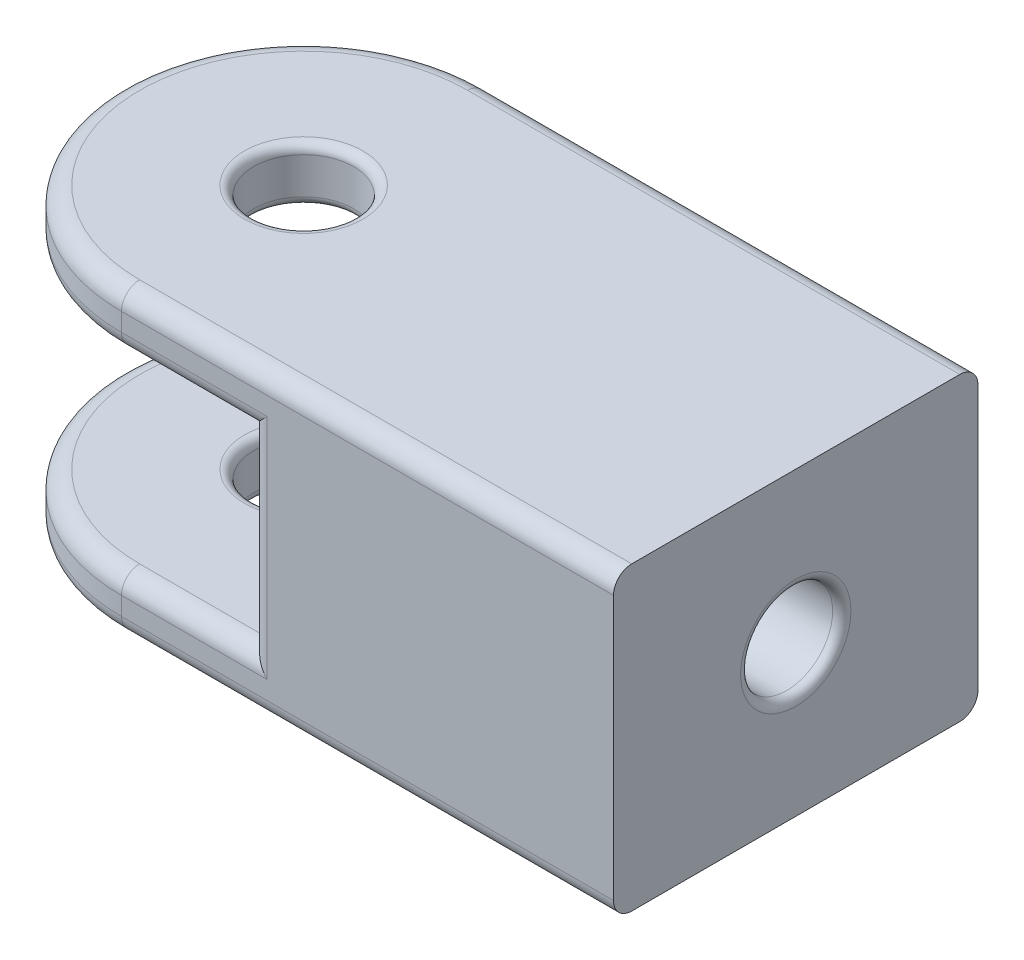
ISO-10303-21;
HEADER;
FILE_DESCRIPTION(('STEP AP214'),'2;1');
FILE_NAME('part.step','',(''),(''),'','','');
FILE_SCHEMA(('AUTOMOTIVE_DESIGN { 1 0 10303 214 1 1 1 1 }'));
ENDSEC;
DATA;
#1=APPLICATION_CONTEXT('core data for automotive mechanical design processes');
#2=APPLICATION_PROTOCOL_DEFINITION('international standard','automotive_design',2000,#1);
#3=PRODUCT_CONTEXT('',#1,'mechanical');
#4=PRODUCT('Part','Part','',(#3));
#5=PRODUCT_RELATED_PRODUCT_CATEGORY('part','',(#4));
#6=PRODUCT_DEFINITION_FORMATION('','',#4);
#7=PRODUCT_DEFINITION_CONTEXT('part definition',#1,'design');
#8=PRODUCT_DEFINITION('design','',#6,#7);
#9=PRODUCT_DEFINITION_SHAPE('','',#8);
#10=(LENGTH_UNIT() NAMED_UNIT(*) SI_UNIT(.MILLI.,.METRE.));
#11=(NAMED_UNIT(*) PLANE_ANGLE_UNIT() SI_UNIT($,.RADIAN.));
#12=(NAMED_UNIT(*) SI_UNIT($,.STERADIAN.) SOLID_ANGLE_UNIT());
#13=UNCERTAINTY_MEASURE_WITH_UNIT(LENGTH_MEASURE(1.E-05),#10,'distance_accuracy_value','');
#14=(GEOMETRIC_REPRESENTATION_CONTEXT(3) GLOBAL_UNCERTAINTY_ASSIGNED_CONTEXT((#13)) GLOBAL_UNIT_ASSIGNED_CONTEXT((#10,
#11,#12)) REPRESENTATION_CONTEXT('',''));
#15=CARTESIAN_POINT('',(0.,0.,0.));
#16=DIRECTION('',(0.,0.,1.));
#17=DIRECTION('',(1.,0.,0.));
#18=AXIS2_PLACEMENT_3D('',#15,#16,#17);
#19=CARTESIAN_POINT('',(0.,-3.,0.));
#20=DIRECTION('',(0.,1.,0.));
#21=DIRECTION('',(0.,0.,1.));
#22=AXIS2_PLACEMENT_3D('',#19,#20,#21);
#23=PLANE('',#22);
#24=CARTESIAN_POINT('',(0.,-3.,0.));
#25=DIRECTION('',(0.,1.,0.));
#26=DIRECTION('',(0.,0.,1.));
#27=AXIS2_PLACEMENT_3D('',#24,#25,#26);
#28=CIRCLE('',#27,3.25);
#29=CARTESIAN_POINT('',(0.,-3.,3.25));
#30=VERTEX_POINT('',#29);
#31=EDGE_CURVE('E290',#30,#30,#28,.T.);
#32=ORIENTED_EDGE('',*,*,#31,.T.);
#33=EDGE_LOOP('',(#32));
#34=FACE_BOUND('',#33,.T.);
#35=CARTESIAN_POINT('',(0.,-3.,0.));
#36=DIRECTION('',(0.,1.,0.));
#37=DIRECTION('',(0.,0.,1.));
#38=AXIS2_PLACEMENT_3D('',#35,#36,#37);
#39=CIRCLE('',#38,9.);
#40=CARTESIAN_POINT('',(0.,-3.,9.));
#41=VERTEX_POINT('',#40);
#42=CARTESIAN_POINT('',(0.,-3.,-9.));
#43=VERTEX_POINT('',#42);
#44=EDGE_CURVE('E205',#41,#43,#39,.F.);
#45=ORIENTED_EDGE('',*,*,#44,.T.);
#46=DIRECTION('',(-1.,0.,0.));
#47=VECTOR('',#46,1.);
#48=CARTESIAN_POINT('',(7.,-3.,-9.));
#49=LINE('',#48,#47);
#50=CARTESIAN_POINT('',(7.,-3.,-9.));
#51=VERTEX_POINT('',#50);
#52=EDGE_CURVE('E209',#43,#51,#49,.F.);
#53=ORIENTED_EDGE('',*,*,#52,.T.);
#54=DIRECTION('',(0.,0.,-1.));
#55=VECTOR('',#54,1.);
#56=CARTESIAN_POINT('',(7.,-3.,0.));
#57=LINE('',#56,#55);
#58=CARTESIAN_POINT('',(7.,-3.,9.));
#59=VERTEX_POINT('',#58);
#60=EDGE_CURVE('E765',#59,#51,#57,.T.);
#61=ORIENTED_EDGE('',*,*,#60,.F.);
#62=DIRECTION('',(1.,0.,0.));
#63=VECTOR('',#62,1.);
#64=CARTESIAN_POINT('',(0.,-3.,9.));
#65=LINE('',#64,#63);
#66=EDGE_CURVE('E207',#59,#41,#65,.F.);
#67=ORIENTED_EDGE('',*,*,#66,.T.);
#68=EDGE_LOOP('',(#45,#53,#61,#67));
#69=FACE_BOUND('',#68,.T.);
#70=ADVANCED_FACE('F39',(#34,#69),#23,.F.);
#71=CARTESIAN_POINT('',(0.,-3.,0.));
#72=DIRECTION('',(0.,1.,0.));
#73=DIRECTION('',(0.,0.,1.));
#74=AXIS2_PLACEMENT_3D('',#71,#72,#73);
#75=CYLINDRICAL_SURFACE('',#74,10.);
#76=DIRECTION('',(0.,1.,0.));
#77=VECTOR('',#76,1.);
#78=CARTESIAN_POINT('',(0.,-3.,-10.));
#79=LINE('',#78,#77);
#80=CARTESIAN_POINT('',(0.,-2.,-10.));
#81=VERTEX_POINT('',#80);
#82=CARTESIAN_POINT('',(0.,-1.,-10.));
#83=VERTEX_POINT('',#82);
#84=EDGE_CURVE('E773',#81,#83,#79,.T.);
#85=ORIENTED_EDGE('',*,*,#84,.F.);
#86=CARTESIAN_POINT('',(0.,-2.,0.));
#87=DIRECTION('',(0.,1.,0.));
#88=DIRECTION('',(0.,0.,1.));
#89=AXIS2_PLACEMENT_3D('',#86,#87,#88);
#90=CIRCLE('',#89,10.);
#91=CARTESIAN_POINT('',(0.,-2.,10.));
#92=VERTEX_POINT('',#91);
#93=EDGE_CURVE('E237',#81,#92,#90,.T.);
#94=ORIENTED_EDGE('',*,*,#93,.T.);
#95=DIRECTION('',(0.,1.,0.));
#96=VECTOR('',#95,1.);
#97=CARTESIAN_POINT('',(0.,-3.,10.));
#98=LINE('',#97,#96);
#99=CARTESIAN_POINT('',(0.,-1.,10.));
#100=VERTEX_POINT('',#99);
#101=EDGE_CURVE('E772',#92,#100,#98,.T.);
#102=ORIENTED_EDGE('',*,*,#101,.T.);
#103=CARTESIAN_POINT('',(0.,-1.,0.));
#104=DIRECTION('',(0.,1.,0.));
#105=DIRECTION('',(0.,0.,1.));
#106=AXIS2_PLACEMENT_3D('',#103,#104,#105);
#107=CIRCLE('',#106,10.);
#108=EDGE_CURVE('E235',#100,#83,#107,.F.);
#109=ORIENTED_EDGE('',*,*,#108,.T.);
#110=EDGE_LOOP('',(#85,#94,#102,#109));
#111=FACE_BOUND('',#110,.T.);
#112=ADVANCED_FACE('F321',(#111),#75,.T.);
#113=CARTESIAN_POINT('',(0.,-3.,-10.));
#114=DIRECTION('',(0.,0.,-1.));
#115=DIRECTION('',(-1.,0.,0.));
#116=AXIS2_PLACEMENT_3D('',#113,#114,#115);
#117=PLANE('',#116);
#118=ORIENTED_EDGE('',*,*,#84,.T.);
#119=DIRECTION('',(-1.,0.,0.));
#120=VECTOR('',#119,1.);
#121=CARTESIAN_POINT('',(0.,-1.,-10.));
#122=LINE('',#121,#120);
#123=CARTESIAN_POINT('',(27.,-1.,-10.));
#124=VERTEX_POINT('',#123);
#125=EDGE_CURVE('E203',#83,#124,#122,.F.);
#126=ORIENTED_EDGE('',*,*,#125,.T.);
#127=DIRECTION('',(0.,1.,0.));
#128=VECTOR('',#127,1.);
#129=CARTESIAN_POINT('',(27.,-16.5,-10.));
#130=LINE('',#129,#128);
#131=CARTESIAN_POINT('',(27.,-15.5,-10.));
#132=VERTEX_POINT('',#131);
#133=EDGE_CURVE('E262',#132,#124,#130,.T.);
#134=ORIENTED_EDGE('',*,*,#133,.F.);
#135=DIRECTION('',(1.,0.,0.));
#136=VECTOR('',#135,1.);
#137=CARTESIAN_POINT('',(0.,-15.5,-10.));
#138=LINE('',#137,#136);
#139=CARTESIAN_POINT('',(0.,-15.5,-10.));
#140=VERTEX_POINT('',#139);
#141=EDGE_CURVE('E201',#132,#140,#138,.F.);
#142=ORIENTED_EDGE('',*,*,#141,.T.);
#143=DIRECTION('',(0.,1.,0.));
#144=VECTOR('',#143,1.);
#145=CARTESIAN_POINT('',(0.,-16.5,-10.));
#146=LINE('',#145,#144);
#147=CARTESIAN_POINT('',(0.,-14.5,-10.));
#148=VERTEX_POINT('',#147);
#149=EDGE_CURVE('E763',#140,#148,#146,.T.);
#150=ORIENTED_EDGE('',*,*,#149,.T.);
#151=DIRECTION('',(1.,0.,0.));
#152=VECTOR('',#151,1.);
#153=CARTESIAN_POINT('',(7.,-14.5,-10.));
#154=LINE('',#153,#152);
#155=CARTESIAN_POINT('',(8.,-14.5,-10.));
#156=VERTEX_POINT('',#155);
#157=EDGE_CURVE('E199',#148,#156,#154,.T.);
#158=ORIENTED_EDGE('',*,*,#157,.T.);
#159=DIRECTION('',(0.,1.,0.));
#160=VECTOR('',#159,1.);
#161=CARTESIAN_POINT('',(8.,-3.,-10.));
#162=LINE('',#161,#160);
#163=CARTESIAN_POINT('',(8.,-2.,-10.));
#164=VERTEX_POINT('',#163);
#165=EDGE_CURVE('E195',#156,#164,#162,.T.);
#166=ORIENTED_EDGE('',*,*,#165,.T.);
#167=DIRECTION('',(-1.,0.,0.));
#168=VECTOR('',#167,1.);
#169=CARTESIAN_POINT('',(0.,-2.,-10.));
#170=LINE('',#169,#168);
#171=EDGE_CURVE('E197',#164,#81,#170,.T.);
#172=ORIENTED_EDGE('',*,*,#171,.T.);
#173=EDGE_LOOP('',(#118,#126,#134,#142,#150,#158,#166,#172));
#174=FACE_BOUND('',#173,.T.);
#175=ADVANCED_FACE('F327',(#174),#117,.T.);
#176=CARTESIAN_POINT('',(10.,-3.,10.));
#177=DIRECTION('',(0.,0.,1.));
#178=DIRECTION('',(1.,0.,0.));
#179=AXIS2_PLACEMENT_3D('',#176,#177,#178);
#180=PLANE('',#179);
#181=DIRECTION('',(0.,-1.,0.));
#182=VECTOR('',#181,1.);
#183=CARTESIAN_POINT('',(27.,0.,10.));
#184=LINE('',#183,#182);
#185=CARTESIAN_POINT('',(27.,-1.,10.));
#186=VERTEX_POINT('',#185);
#187=CARTESIAN_POINT('',(27.,-15.5,10.));
#188=VERTEX_POINT('',#187);
#189=EDGE_CURVE('E159',#186,#188,#184,.T.);
#190=ORIENTED_EDGE('',*,*,#189,.F.);
#191=DIRECTION('',(1.,0.,0.));
#192=VECTOR('',#191,1.);
#193=CARTESIAN_POINT('',(10.,-1.,10.));
#194=LINE('',#193,#192);
#195=EDGE_CURVE('E172',#186,#100,#194,.F.);
#196=ORIENTED_EDGE('',*,*,#195,.T.);
#197=ORIENTED_EDGE('',*,*,#101,.F.);
#198=DIRECTION('',(1.,0.,0.));
#199=VECTOR('',#198,1.);
#200=CARTESIAN_POINT('',(7.,-2.,10.));
#201=LINE('',#200,#199);
#202=CARTESIAN_POINT('',(8.,-2.,10.));
#203=VERTEX_POINT('',#202);
#204=EDGE_CURVE('E760',#92,#203,#201,.T.);
#205=ORIENTED_EDGE('',*,*,#204,.T.);
#206=DIRECTION('',(0.,-1.,0.));
#207=VECTOR('',#206,1.);
#208=CARTESIAN_POINT('',(8.,-13.5,10.));
#209=LINE('',#208,#207);
#210=CARTESIAN_POINT('',(8.,-14.5,10.));
#211=VERTEX_POINT('',#210);
#212=EDGE_CURVE('E759',#203,#211,#209,.T.);
#213=ORIENTED_EDGE('',*,*,#212,.T.);
#214=DIRECTION('',(-1.,0.,0.));
#215=VECTOR('',#214,1.);
#216=CARTESIAN_POINT('',(0.,-14.5,10.));
#217=LINE('',#216,#215);
#218=CARTESIAN_POINT('',(0.,-14.5,10.));
#219=VERTEX_POINT('',#218);
#220=EDGE_CURVE('E187',#211,#219,#217,.T.);
#221=ORIENTED_EDGE('',*,*,#220,.T.);
#222=DIRECTION('',(0.,1.,0.));
#223=VECTOR('',#222,1.);
#224=CARTESIAN_POINT('',(0.,-16.5,10.));
#225=LINE('',#224,#223);
#226=CARTESIAN_POINT('',(0.,-15.5,10.));
#227=VERTEX_POINT('',#226);
#228=EDGE_CURVE('E757',#227,#219,#225,.T.);
#229=ORIENTED_EDGE('',*,*,#228,.F.);
#230=DIRECTION('',(-1.,0.,0.));
#231=VECTOR('',#230,1.);
#232=CARTESIAN_POINT('',(10.,-15.5,10.));
#233=LINE('',#232,#231);
#234=EDGE_CURVE('E175',#227,#188,#233,.F.);
#235=ORIENTED_EDGE('',*,*,#234,.T.);
#236=EDGE_LOOP('',(#190,#196,#197,#205,#213,#221,#229,#235));
#237=FACE_BOUND('',#236,.T.);
#238=ADVANCED_FACE('F170',(#237),#180,.T.);
#239=CARTESIAN_POINT('',(0.,0.,0.));
#240=DIRECTION('',(0.,1.,0.));
#241=DIRECTION('',(0.,0.,1.));
#242=AXIS2_PLACEMENT_3D('',#239,#240,#241);
#243=PLANE('',#242);
#244=CARTESIAN_POINT('',(0.,0.,0.));
#245=DIRECTION('',(0.,1.,0.));
#246=DIRECTION('',(0.,0.,1.));
#247=AXIS2_PLACEMENT_3D('',#244,#245,#246);
#248=CIRCLE('',#247,3.25);
#249=CARTESIAN_POINT('',(0.,0.,3.25));
#250=VERTEX_POINT('',#249);
#251=EDGE_CURVE('E287',#250,#250,#248,.F.);
#252=ORIENTED_EDGE('',*,*,#251,.T.);
#253=EDGE_LOOP('',(#252));
#254=FACE_BOUND('',#253,.T.);
#255=DIRECTION('',(0.,0.,1.));
#256=VECTOR('',#255,1.);
#257=CARTESIAN_POINT('',(27.,0.,-10.));
#258=LINE('',#257,#256);
#259=CARTESIAN_POINT('',(27.,0.,-8.99999999999999));
#260=VERTEX_POINT('',#259);
#261=CARTESIAN_POINT('',(27.,0.,8.99999999999999));
#262=VERTEX_POINT('',#261);
#263=EDGE_CURVE('E162',#260,#262,#258,.T.);
#264=ORIENTED_EDGE('',*,*,#263,.F.);
#265=DIRECTION('',(-1.,0.,0.));
#266=VECTOR('',#265,1.);
#267=CARTESIAN_POINT('',(0.,0.,-9.));
#268=LINE('',#267,#266);
#269=CARTESIAN_POINT('',(0.,0.,-9.));
#270=VERTEX_POINT('',#269);
#271=EDGE_CURVE('E215',#260,#270,#268,.T.);
#272=ORIENTED_EDGE('',*,*,#271,.T.);
#273=CARTESIAN_POINT('',(0.,0.,0.));
#274=DIRECTION('',(0.,1.,0.));
#275=DIRECTION('',(0.,0.,1.));
#276=AXIS2_PLACEMENT_3D('',#273,#274,#275);
#277=CIRCLE('',#276,9.);
#278=CARTESIAN_POINT('',(0.,0.,9.));
#279=VERTEX_POINT('',#278);
#280=EDGE_CURVE('E211',#270,#279,#277,.T.);
#281=ORIENTED_EDGE('',*,*,#280,.T.);
#282=DIRECTION('',(1.,0.,0.));
#283=VECTOR('',#282,1.);
#284=CARTESIAN_POINT('',(0.,0.,9.));
#285=LINE('',#284,#283);
#286=EDGE_CURVE('E213',#279,#262,#285,.T.);
#287=ORIENTED_EDGE('',*,*,#286,.T.);
#288=EDGE_LOOP('',(#264,#272,#281,#287));
#289=FACE_BOUND('',#288,.T.);
#290=ADVANCED_FACE('F335',(#254,#289),#243,.T.);
#291=CARTESIAN_POINT('',(0.,-3.,0.));
#292=DIRECTION('',(0.,1.,0.));
#293=DIRECTION('',(0.,0.,1.));
#294=AXIS2_PLACEMENT_3D('',#291,#292,#293);
#295=CYLINDRICAL_SURFACE('',#294,2.75);
#296=CARTESIAN_POINT('',(0.,-0.5,0.));
#297=DIRECTION('',(0.,1.,0.));
#298=DIRECTION('',(0.,0.,1.));
#299=AXIS2_PLACEMENT_3D('',#296,#297,#298);
#300=CIRCLE('',#299,2.75);
#301=CARTESIAN_POINT('',(0.,-0.5,2.75));
#302=VERTEX_POINT('',#301);
#303=EDGE_CURVE('E284',#302,#302,#300,.T.);
#304=ORIENTED_EDGE('',*,*,#303,.T.);
#305=EDGE_LOOP('',(#304));
#306=FACE_BOUND('',#305,.T.);
#307=CARTESIAN_POINT('',(0.,-2.5,0.));
#308=DIRECTION('',(0.,1.,0.));
#309=DIRECTION('',(0.,0.,1.));
#310=AXIS2_PLACEMENT_3D('',#307,#308,#309);
#311=CIRCLE('',#310,2.75);
#312=CARTESIAN_POINT('',(0.,-2.5,2.75));
#313=VERTEX_POINT('',#312);
#314=EDGE_CURVE('E281',#313,#313,#311,.F.);
#315=ORIENTED_EDGE('',*,*,#314,.T.);
#316=EDGE_LOOP('',(#315));
#317=FACE_BOUND('',#316,.T.);
#318=ADVANCED_FACE('F333',(#306,#317),#295,.F.);
#319=CARTESIAN_POINT('',(7.,0.,0.));
#320=DIRECTION('',(1.,0.,0.));
#321=DIRECTION('',(0.,0.,-1.));
#322=AXIS2_PLACEMENT_3D('',#319,#320,#321);
#323=PLANE('',#322);
#324=DIRECTION('',(0.,0.,-1.));
#325=VECTOR('',#324,1.);
#326=CARTESIAN_POINT('',(7.,-13.5,9.99999999999999));
#327=LINE('',#326,#325);
#328=CARTESIAN_POINT('',(7.,-13.5,9.));
#329=VERTEX_POINT('',#328);
#330=CARTESIAN_POINT('',(7.,-13.5,-9.));
#331=VERTEX_POINT('',#330);
#332=EDGE_CURVE('E762',#329,#331,#327,.T.);
#333=ORIENTED_EDGE('',*,*,#332,.F.);
#334=DIRECTION('',(0.,-1.,0.));
#335=VECTOR('',#334,1.);
#336=CARTESIAN_POINT('',(7.,-3.,9.));
#337=LINE('',#336,#335);
#338=EDGE_CURVE('E229',#329,#59,#337,.F.);
#339=ORIENTED_EDGE('',*,*,#338,.T.);
#340=ORIENTED_EDGE('',*,*,#60,.T.);
#341=DIRECTION('',(0.,1.,0.));
#342=VECTOR('',#341,1.);
#343=CARTESIAN_POINT('',(7.,-13.5,-9.));
#344=LINE('',#343,#342);
#345=EDGE_CURVE('E227',#51,#331,#344,.F.);
#346=ORIENTED_EDGE('',*,*,#345,.T.);
#347=EDGE_LOOP('',(#333,#339,#340,#346));
#348=FACE_BOUND('',#347,.T.);
#349=ADVANCED_FACE('F418',(#348),#323,.F.);
#350=CARTESIAN_POINT('',(0.,-13.5,0.));
#351=DIRECTION('',(0.,-1.,0.));
#352=DIRECTION('',(0.,0.,-1.));
#353=AXIS2_PLACEMENT_3D('',#350,#351,#352);
#354=PLANE('',#353);
#355=CARTESIAN_POINT('',(0.,-13.5,0.));
#356=DIRECTION('',(0.,-1.,0.));
#357=DIRECTION('',(0.,0.,-1.));
#358=AXIS2_PLACEMENT_3D('',#355,#356,#357);
#359=CIRCLE('',#358,3.25);
#360=CARTESIAN_POINT('',(0.,-13.5,-3.25));
#361=VERTEX_POINT('',#360);
#362=EDGE_CURVE('E239',#361,#361,#359,.T.);
#363=ORIENTED_EDGE('',*,*,#362,.T.);
#364=EDGE_LOOP('',(#363));
#365=FACE_BOUND('',#364,.T.);
#366=CARTESIAN_POINT('',(0.,-13.5,0.));
#367=DIRECTION('',(0.,-1.,0.));
#368=DIRECTION('',(0.,0.,-1.));
#369=AXIS2_PLACEMENT_3D('',#366,#367,#368);
#370=CIRCLE('',#369,9.);
#371=CARTESIAN_POINT('',(0.,-13.5,-9.));
#372=VERTEX_POINT('',#371);
#373=CARTESIAN_POINT('',(0.,-13.5,9.));
#374=VERTEX_POINT('',#373);
#375=EDGE_CURVE('E183',#372,#374,#370,.F.);
#376=ORIENTED_EDGE('',*,*,#375,.T.);
#377=DIRECTION('',(-1.,0.,0.));
#378=VECTOR('',#377,1.);
#379=CARTESIAN_POINT('',(7.,-13.5,9.));
#380=LINE('',#379,#378);
#381=EDGE_CURVE('E192',#374,#329,#380,.F.);
#382=ORIENTED_EDGE('',*,*,#381,.T.);
#383=ORIENTED_EDGE('',*,*,#332,.T.);
#384=DIRECTION('',(1.,0.,0.));
#385=VECTOR('',#384,1.);
#386=CARTESIAN_POINT('',(0.,-13.5,-9.));
#387=LINE('',#386,#385);
#388=EDGE_CURVE('E185',#331,#372,#387,.F.);
#389=ORIENTED_EDGE('',*,*,#388,.T.);
#390=EDGE_LOOP('',(#376,#382,#383,#389));
#391=FACE_BOUND('',#390,.T.);
#392=ADVANCED_FACE('F423',(#365,#391),#354,.F.);
#393=CARTESIAN_POINT('',(0.,-16.5,0.));
#394=DIRECTION('',(0.,-1.,0.));
#395=DIRECTION('',(0.,0.,-1.));
#396=AXIS2_PLACEMENT_3D('',#393,#394,#395);
#397=PLANE('',#396);
#398=CARTESIAN_POINT('',(0.,-16.5,0.));
#399=DIRECTION('',(0.,-1.,0.));
#400=DIRECTION('',(0.,0.,-1.));
#401=AXIS2_PLACEMENT_3D('',#398,#399,#400);
#402=CIRCLE('',#401,3.25);
#403=CARTESIAN_POINT('',(0.,-16.5,-3.25));
#404=VERTEX_POINT('',#403);
#405=EDGE_CURVE('E278',#404,#404,#402,.F.);
#406=ORIENTED_EDGE('',*,*,#405,.T.);
#407=EDGE_LOOP('',(#406));
#408=FACE_BOUND('',#407,.T.);
#409=DIRECTION('',(0.,0.,-1.));
#410=VECTOR('',#409,1.);
#411=CARTESIAN_POINT('',(27.,-16.5,10.));
#412=LINE('',#411,#410);
#413=CARTESIAN_POINT('',(27.,-16.5,8.99999999999999));
#414=VERTEX_POINT('',#413);
#415=CARTESIAN_POINT('',(27.,-16.5,-8.99999999999999));
#416=VERTEX_POINT('',#415);
#417=EDGE_CURVE('E176',#414,#416,#412,.T.);
#418=ORIENTED_EDGE('',*,*,#417,.F.);
#419=DIRECTION('',(-1.,0.,0.));
#420=VECTOR('',#419,1.);
#421=CARTESIAN_POINT('',(0.,-16.5,9.));
#422=LINE('',#421,#420);
#423=CARTESIAN_POINT('',(0.,-16.5,9.));
#424=VERTEX_POINT('',#423);
#425=EDGE_CURVE('E225',#414,#424,#422,.T.);
#426=ORIENTED_EDGE('',*,*,#425,.T.);
#427=CARTESIAN_POINT('',(0.,-16.5,0.));
#428=DIRECTION('',(0.,-1.,0.));
#429=DIRECTION('',(0.,0.,-1.));
#430=AXIS2_PLACEMENT_3D('',#427,#428,#429);
#431=CIRCLE('',#430,9.);
#432=CARTESIAN_POINT('',(0.,-16.5,-9.));
#433=VERTEX_POINT('',#432);
#434=EDGE_CURVE('E54',#424,#433,#431,.T.);
#435=ORIENTED_EDGE('',*,*,#434,.T.);
#436=DIRECTION('',(1.,0.,0.));
#437=VECTOR('',#436,1.);
#438=CARTESIAN_POINT('',(0.,-16.5,-9.));
#439=LINE('',#438,#437);
#440=EDGE_CURVE('E223',#433,#416,#439,.T.);
#441=ORIENTED_EDGE('',*,*,#440,.T.);
#442=EDGE_LOOP('',(#418,#426,#435,#441));
#443=FACE_BOUND('',#442,.T.);
#444=ADVANCED_FACE('F430',(#408,#443),#397,.T.);
#445=CARTESIAN_POINT('',(0.,-16.5,0.));
#446=DIRECTION('',(0.,1.,0.));
#447=DIRECTION('',(0.,0.,1.));
#448=AXIS2_PLACEMENT_3D('',#445,#446,#447);
#449=CYLINDRICAL_SURFACE('',#448,10.);
#450=ORIENTED_EDGE('',*,*,#228,.T.);
#451=CARTESIAN_POINT('',(0.,-14.5,0.));
#452=DIRECTION('',(0.,-1.,0.));
#453=DIRECTION('',(0.,0.,-1.));
#454=AXIS2_PLACEMENT_3D('',#451,#452,#453);
#455=CIRCLE('',#454,10.);
#456=EDGE_CURVE('E233',#219,#148,#455,.T.);
#457=ORIENTED_EDGE('',*,*,#456,.T.);
#458=ORIENTED_EDGE('',*,*,#149,.F.);
#459=CARTESIAN_POINT('',(0.,-15.5,0.));
#460=DIRECTION('',(0.,-1.,0.));
#461=DIRECTION('',(0.,0.,-1.));
#462=AXIS2_PLACEMENT_3D('',#459,#460,#461);
#463=CIRCLE('',#462,10.);
#464=EDGE_CURVE('E231',#140,#227,#463,.F.);
#465=ORIENTED_EDGE('',*,*,#464,.T.);
#466=EDGE_LOOP('',(#450,#457,#458,#465));
#467=FACE_BOUND('',#466,.T.);
#468=ADVANCED_FACE('F435',(#467),#449,.T.);
#469=CARTESIAN_POINT('',(0.,-16.5,0.));
#470=DIRECTION('',(0.,1.,0.));
#471=DIRECTION('',(0.,0.,1.));
#472=AXIS2_PLACEMENT_3D('',#469,#470,#471);
#473=CYLINDRICAL_SURFACE('',#472,2.75);
#474=CARTESIAN_POINT('',(0.,-14.,0.));
#475=DIRECTION('',(0.,-1.,0.));
#476=DIRECTION('',(0.,0.,-1.));
#477=AXIS2_PLACEMENT_3D('',#474,#475,#476);
#478=CIRCLE('',#477,2.75);
#479=CARTESIAN_POINT('',(0.,-14.,-2.75));
#480=VERTEX_POINT('',#479);
#481=EDGE_CURVE('E275',#480,#480,#478,.F.);
#482=ORIENTED_EDGE('',*,*,#481,.T.);
#483=EDGE_LOOP('',(#482));
#484=FACE_BOUND('',#483,.T.);
#485=CARTESIAN_POINT('',(0.,-16.,0.));
#486=DIRECTION('',(0.,-1.,0.));
#487=DIRECTION('',(0.,0.,-1.));
#488=AXIS2_PLACEMENT_3D('',#485,#486,#487);
#489=CIRCLE('',#488,2.75);
#490=CARTESIAN_POINT('',(0.,-16.,-2.75));
#491=VERTEX_POINT('',#490);
#492=EDGE_CURVE('E272',#491,#491,#489,.T.);
#493=ORIENTED_EDGE('',*,*,#492,.T.);
#494=EDGE_LOOP('',(#493));
#495=FACE_BOUND('',#494,.T.);
#496=ADVANCED_FACE('F437',(#484,#495),#473,.F.);
#497=CARTESIAN_POINT('',(27.,0.,0.));
#498=DIRECTION('',(1.,0.,0.));
#499=DIRECTION('',(0.,0.,-1.));
#500=AXIS2_PLACEMENT_3D('',#497,#498,#499);
#501=PLANE('',#500);
#502=CARTESIAN_POINT('',(27.,-8.25,0.));
#503=DIRECTION('',(1.,0.,0.));
#504=DIRECTION('',(0.,0.,-1.));
#505=AXIS2_PLACEMENT_3D('',#502,#503,#504);
#506=CIRCLE('',#505,3.025);
#507=CARTESIAN_POINT('',(27.,-8.25,-3.025));
#508=VERTEX_POINT('',#507);
#509=EDGE_CURVE('E47',#508,#508,#506,.F.);
#510=ORIENTED_EDGE('',*,*,#509,.T.);
#511=EDGE_LOOP('',(#510));
#512=FACE_BOUND('',#511,.T.);
#513=ORIENTED_EDGE('',*,*,#133,.T.);
#514=CARTESIAN_POINT('',(27.,-1.,-8.99999999999999));
#515=DIRECTION('',(1.,0.,0.));
#516=DIRECTION('',(0.,0.,-1.));
#517=AXIS2_PLACEMENT_3D('',#514,#515,#516);
#518=CIRCLE('',#517,1.);
#519=EDGE_CURVE('E166',#124,#260,#518,.T.);
#520=ORIENTED_EDGE('',*,*,#519,.T.);
#521=ORIENTED_EDGE('',*,*,#263,.T.);
#522=CARTESIAN_POINT('',(27.,-1.,8.99999999999999));
#523=DIRECTION('',(1.,0.,0.));
#524=DIRECTION('',(0.,0.,-1.));
#525=AXIS2_PLACEMENT_3D('',#522,#523,#524);
#526=CIRCLE('',#525,1.);
#527=EDGE_CURVE('E155',#262,#186,#526,.T.);
#528=ORIENTED_EDGE('',*,*,#527,.T.);
#529=ORIENTED_EDGE('',*,*,#189,.T.);
#530=CARTESIAN_POINT('',(27.,-15.5,8.99999999999999));
#531=DIRECTION('',(1.,0.,0.));
#532=DIRECTION('',(0.,0.,-1.));
#533=AXIS2_PLACEMENT_3D('',#530,#531,#532);
#534=CIRCLE('',#533,1.);
#535=EDGE_CURVE('E167',#188,#414,#534,.T.);
#536=ORIENTED_EDGE('',*,*,#535,.T.);
#537=ORIENTED_EDGE('',*,*,#417,.T.);
#538=CARTESIAN_POINT('',(27.,-15.5,-8.99999999999999));
#539=DIRECTION('',(1.,0.,0.));
#540=DIRECTION('',(0.,0.,-1.));
#541=AXIS2_PLACEMENT_3D('',#538,#539,#540);
#542=CIRCLE('',#541,1.);
#543=EDGE_CURVE('E218',#416,#132,#542,.T.);
#544=ORIENTED_EDGE('',*,*,#543,.T.);
#545=EDGE_LOOP('',(#513,#520,#521,#528,#529,#536,#537,#544));
#546=FACE_BOUND('',#545,.T.);
#547=ADVANCED_FACE('F158',(#512,#546),#501,.T.);
#548=CARTESIAN_POINT('',(-0.141778489984128,-8.25,0.));
#549=DIRECTION('',(1.,0.,0.));
#550=DIRECTION('',(0.,0.,-1.));
#551=AXIS2_PLACEMENT_3D('',#548,#549,#550);
#552=CYLINDRICAL_SURFACE('',#551,2.525);
#553=CARTESIAN_POINT('',(26.5,-8.25,0.));
#554=DIRECTION('',(1.,0.,0.));
#555=DIRECTION('',(0.,0.,-1.));
#556=AXIS2_PLACEMENT_3D('',#553,#554,#555);
#557=CIRCLE('',#556,2.525);
#558=CARTESIAN_POINT('',(26.5,-8.25,-2.525));
#559=VERTEX_POINT('',#558);
#560=EDGE_CURVE('E296',#559,#559,#557,.T.);
#561=ORIENTED_EDGE('',*,*,#560,.T.);
#562=EDGE_LOOP('',(#561));
#563=FACE_BOUND('',#562,.T.);
#564=CARTESIAN_POINT('',(10.5,-8.25,0.));
#565=DIRECTION('',(1.,0.,0.));
#566=DIRECTION('',(0.,0.,-1.));
#567=AXIS2_PLACEMENT_3D('',#564,#565,#566);
#568=CIRCLE('',#567,2.525);
#569=CARTESIAN_POINT('',(10.5,-8.25,-2.525));
#570=VERTEX_POINT('',#569);
#571=EDGE_CURVE('E293',#570,#570,#568,.F.);
#572=ORIENTED_EDGE('',*,*,#571,.T.);
#573=EDGE_LOOP('',(#572));
#574=FACE_BOUND('',#573,.T.);
#575=ADVANCED_FACE('F308',(#563,#574),#552,.F.);
#576=CARTESIAN_POINT('',(10.,0.,0.));
#577=DIRECTION('',(1.,0.,0.));
#578=DIRECTION('',(0.,0.,-1.));
#579=AXIS2_PLACEMENT_3D('',#576,#577,#578);
#580=PLANE('',#579);
#581=CARTESIAN_POINT('',(10.,-8.25,0.));
#582=DIRECTION('',(1.,0.,0.));
#583=DIRECTION('',(0.,0.,-1.));
#584=AXIS2_PLACEMENT_3D('',#581,#582,#583);
#585=CIRCLE('',#584,2.025);
#586=CARTESIAN_POINT('',(10.,-8.25,-2.025));
#587=VERTEX_POINT('',#586);
#588=EDGE_CURVE('E12',#587,#587,#585,.T.);
#589=ORIENTED_EDGE('',*,*,#588,.T.);
#590=EDGE_LOOP('',(#589));
#591=FACE_BOUND('',#590,.T.);
#592=ADVANCED_FACE('F311',(#591),#580,.T.);
#593=CARTESIAN_POINT('',(0.,-2.,-9.));
#594=DIRECTION('',(1.,0.,0.));
#595=DIRECTION('',(0.,0.,-1.));
#596=AXIS2_PLACEMENT_3D('',#593,#594,#595);
#597=CYLINDRICAL_SURFACE('',#596,1.);
#598=CARTESIAN_POINT('',(8.,-2.,-9.));
#599=DIRECTION('',(0.707106781186547,-0.707106781186547,0.));
#600=DIRECTION('',(0.707106781186547,0.707106781186547,0.));
#601=AXIS2_PLACEMENT_3D('',#598,#599,#600);
#602=ELLIPSE('',#601,1.41421356237309,1.);
#603=EDGE_CURVE('E256',#51,#164,#602,.T.);
#604=ORIENTED_EDGE('',*,*,#603,.F.);
#605=ORIENTED_EDGE('',*,*,#52,.F.);
#606=CARTESIAN_POINT('',(0.,-2.,-9.));
#607=DIRECTION('',(-1.,0.,0.));
#608=DIRECTION('',(0.,0.,1.));
#609=AXIS2_PLACEMENT_3D('',#606,#607,#608);
#610=CIRCLE('',#609,1.);
#611=EDGE_CURVE('E259',#81,#43,#610,.T.);
#612=ORIENTED_EDGE('',*,*,#611,.F.);
#613=ORIENTED_EDGE('',*,*,#171,.F.);
#614=EDGE_LOOP('',(#604,#605,#612,#613));
#615=FACE_BOUND('',#614,.T.);
#616=ADVANCED_FACE('F371',(#615),#597,.T.);
#617=CARTESIAN_POINT('',(0.,-2.,0.));
#618=DIRECTION('',(0.,1.,0.));
#619=DIRECTION('',(0.,0.,1.));
#620=AXIS2_PLACEMENT_3D('',#617,#618,#619);
#621=TOROIDAL_SURFACE('',#620,9.,1.);
#622=ORIENTED_EDGE('',*,*,#611,.T.);
#623=ORIENTED_EDGE('',*,*,#44,.F.);
#624=CARTESIAN_POINT('',(0.,-2.,9.));
#625=DIRECTION('',(1.,0.,0.));
#626=DIRECTION('',(0.,1.,0.));
#627=AXIS2_PLACEMENT_3D('',#624,#625,#626);
#628=CIRCLE('',#627,1.);
#629=EDGE_CURVE('E253',#92,#41,#628,.T.);
#630=ORIENTED_EDGE('',*,*,#629,.F.);
#631=ORIENTED_EDGE('',*,*,#93,.F.);
#632=EDGE_LOOP('',(#622,#623,#630,#631));
#633=FACE_BOUND('',#632,.T.);
#634=ADVANCED_FACE('F367',(#633),#621,.T.);
#635=CARTESIAN_POINT('',(8.,-3.,-9.));
#636=DIRECTION('',(0.,-1.,0.));
#637=DIRECTION('',(0.,0.,-1.));
#638=AXIS2_PLACEMENT_3D('',#635,#636,#637);
#639=CYLINDRICAL_SURFACE('',#638,1.);
#640=ORIENTED_EDGE('',*,*,#603,.T.);
#641=ORIENTED_EDGE('',*,*,#165,.F.);
#642=CARTESIAN_POINT('',(8.,-14.5,-9.));
#643=DIRECTION('',(-0.707106781186547,-0.707106781186547,0.));
#644=DIRECTION('',(-0.707106781186547,0.707106781186547,0.));
#645=AXIS2_PLACEMENT_3D('',#642,#643,#644);
#646=ELLIPSE('',#645,1.41421356237309,1.);
#647=EDGE_CURVE('E250',#331,#156,#646,.T.);
#648=ORIENTED_EDGE('',*,*,#647,.F.);
#649=ORIENTED_EDGE('',*,*,#345,.F.);
#650=EDGE_LOOP('',(#640,#641,#648,#649));
#651=FACE_BOUND('',#650,.T.);
#652=ADVANCED_FACE('F363',(#651),#639,.T.);
#653=CARTESIAN_POINT('',(10.,-2.,9.));
#654=DIRECTION('',(-1.,0.,0.));
#655=DIRECTION('',(0.,0.,1.));
#656=AXIS2_PLACEMENT_3D('',#653,#654,#655);
#657=CYLINDRICAL_SURFACE('',#656,1.);
#658=ORIENTED_EDGE('',*,*,#629,.T.);
#659=ORIENTED_EDGE('',*,*,#66,.F.);
#660=CARTESIAN_POINT('',(8.,-2.,9.));
#661=DIRECTION('',(-0.707106781186547,0.707106781186547,0.));
#662=DIRECTION('',(-0.707106781186547,-0.707106781186547,0.));
#663=AXIS2_PLACEMENT_3D('',#660,#661,#662);
#664=ELLIPSE('',#663,1.41421356237309,1.);
#665=EDGE_CURVE('E247',#203,#59,#664,.F.);
#666=ORIENTED_EDGE('',*,*,#665,.F.);
#667=ORIENTED_EDGE('',*,*,#204,.F.);
#668=EDGE_LOOP('',(#658,#659,#666,#667));
#669=FACE_BOUND('',#668,.T.);
#670=ADVANCED_FACE('F359',(#669),#657,.T.);
#671=CARTESIAN_POINT('',(0.,-14.5,-9.));
#672=DIRECTION('',(-1.,0.,0.));
#673=DIRECTION('',(0.,0.,1.));
#674=AXIS2_PLACEMENT_3D('',#671,#672,#673);
#675=CYLINDRICAL_SURFACE('',#674,1.);
#676=ORIENTED_EDGE('',*,*,#647,.T.);
#677=ORIENTED_EDGE('',*,*,#157,.F.);
#678=CARTESIAN_POINT('',(0.,-14.5,-9.));
#679=DIRECTION('',(-1.,0.,0.));
#680=DIRECTION('',(0.,0.,1.));
#681=AXIS2_PLACEMENT_3D('',#678,#679,#680);
#682=CIRCLE('',#681,1.);
#683=EDGE_CURVE('E244',#372,#148,#682,.T.);
#684=ORIENTED_EDGE('',*,*,#683,.F.);
#685=ORIENTED_EDGE('',*,*,#388,.F.);
#686=EDGE_LOOP('',(#676,#677,#684,#685));
#687=FACE_BOUND('',#686,.T.);
#688=ADVANCED_FACE('F355',(#687),#675,.T.);
#689=CARTESIAN_POINT('',(8.,-3.,9.));
#690=DIRECTION('',(0.,1.,0.));
#691=DIRECTION('',(0.,0.,1.));
#692=AXIS2_PLACEMENT_3D('',#689,#690,#691);
#693=CYLINDRICAL_SURFACE('',#692,1.);
#694=ORIENTED_EDGE('',*,*,#665,.T.);
#695=ORIENTED_EDGE('',*,*,#338,.F.);
#696=CARTESIAN_POINT('',(8.,-14.5,9.));
#697=DIRECTION('',(0.707106781186547,0.707106781186547,0.));
#698=DIRECTION('',(0.707106781186547,-0.707106781186547,0.));
#699=AXIS2_PLACEMENT_3D('',#696,#697,#698);
#700=ELLIPSE('',#699,1.41421356237309,1.);
#701=EDGE_CURVE('E242',#211,#329,#700,.F.);
#702=ORIENTED_EDGE('',*,*,#701,.F.);
#703=ORIENTED_EDGE('',*,*,#212,.F.);
#704=EDGE_LOOP('',(#694,#695,#702,#703));
#705=FACE_BOUND('',#704,.T.);
#706=ADVANCED_FACE('F351',(#705),#693,.T.);
#707=CARTESIAN_POINT('',(0.,-14.5,0.));
#708=DIRECTION('',(0.,-1.,0.));
#709=DIRECTION('',(0.,0.,-1.));
#710=AXIS2_PLACEMENT_3D('',#707,#708,#709);
#711=TOROIDAL_SURFACE('',#710,9.,1.);
#712=ORIENTED_EDGE('',*,*,#683,.T.);
#713=ORIENTED_EDGE('',*,*,#456,.F.);
#714=CARTESIAN_POINT('',(0.,-14.5,9.));
#715=DIRECTION('',(1.,0.,0.));
#716=DIRECTION('',(0.,0.,-1.));
#717=AXIS2_PLACEMENT_3D('',#714,#715,#716);
#718=CIRCLE('',#717,1.);
#719=EDGE_CURVE('E240',#374,#219,#718,.T.);
#720=ORIENTED_EDGE('',*,*,#719,.F.);
#721=ORIENTED_EDGE('',*,*,#375,.F.);
#722=EDGE_LOOP('',(#712,#713,#720,#721));
#723=FACE_BOUND('',#722,.T.);
#724=ADVANCED_FACE('F347',(#723),#711,.T.);
#725=CARTESIAN_POINT('',(10.,-14.5,9.));
#726=DIRECTION('',(1.,0.,0.));
#727=DIRECTION('',(0.,0.,-1.));
#728=AXIS2_PLACEMENT_3D('',#725,#726,#727);
#729=CYLINDRICAL_SURFACE('',#728,1.);
#730=ORIENTED_EDGE('',*,*,#701,.T.);
#731=ORIENTED_EDGE('',*,*,#381,.F.);
#732=ORIENTED_EDGE('',*,*,#719,.T.);
#733=ORIENTED_EDGE('',*,*,#220,.F.);
#734=EDGE_LOOP('',(#730,#731,#732,#733));
#735=FACE_BOUND('',#734,.T.);
#736=ADVANCED_FACE('F344',(#735),#729,.T.);
#737=CARTESIAN_POINT('',(0.,-1.,9.));
#738=DIRECTION('',(1.,0.,0.));
#739=DIRECTION('',(0.,0.,-1.));
#740=AXIS2_PLACEMENT_3D('',#737,#738,#739);
#741=CYLINDRICAL_SURFACE('',#740,1.);
#742=ORIENTED_EDGE('',*,*,#527,.F.);
#743=ORIENTED_EDGE('',*,*,#286,.F.);
#744=CARTESIAN_POINT('',(0.,-1.,9.));
#745=DIRECTION('',(-1.,0.,0.));
#746=DIRECTION('',(0.,0.,1.));
#747=AXIS2_PLACEMENT_3D('',#744,#745,#746);
#748=CIRCLE('',#747,1.);
#749=EDGE_CURVE('E181',#100,#279,#748,.T.);
#750=ORIENTED_EDGE('',*,*,#749,.F.);
#751=ORIENTED_EDGE('',*,*,#195,.F.);
#752=EDGE_LOOP('',(#742,#743,#750,#751));
#753=FACE_BOUND('',#752,.T.);
#754=ADVANCED_FACE('F179',(#753),#741,.T.);
#755=CARTESIAN_POINT('',(0.,-1.,0.));
#756=DIRECTION('',(0.,1.,0.));
#757=DIRECTION('',(0.,0.,1.));
#758=AXIS2_PLACEMENT_3D('',#755,#756,#757);
#759=TOROIDAL_SURFACE('',#758,9.,1.);
#760=ORIENTED_EDGE('',*,*,#749,.T.);
#761=ORIENTED_EDGE('',*,*,#280,.F.);
#762=CARTESIAN_POINT('',(0.,-1.,-9.));
#763=DIRECTION('',(1.,0.,0.));
#764=DIRECTION('',(0.,1.,0.));
#765=AXIS2_PLACEMENT_3D('',#762,#763,#764);
#766=CIRCLE('',#765,1.);
#767=EDGE_CURVE('E263',#83,#270,#766,.T.);
#768=ORIENTED_EDGE('',*,*,#767,.F.);
#769=ORIENTED_EDGE('',*,*,#108,.F.);
#770=EDGE_LOOP('',(#760,#761,#768,#769));
#771=FACE_BOUND('',#770,.T.);
#772=ADVANCED_FACE('F380',(#771),#759,.T.);
#773=CARTESIAN_POINT('',(0.,-1.,-9.));
#774=DIRECTION('',(-1.,0.,0.));
#775=DIRECTION('',(0.,0.,1.));
#776=AXIS2_PLACEMENT_3D('',#773,#774,#775);
#777=CYLINDRICAL_SURFACE('',#776,1.);
#778=ORIENTED_EDGE('',*,*,#519,.F.);
#779=ORIENTED_EDGE('',*,*,#125,.F.);
#780=ORIENTED_EDGE('',*,*,#767,.T.);
#781=ORIENTED_EDGE('',*,*,#271,.F.);
#782=EDGE_LOOP('',(#778,#779,#780,#781));
#783=FACE_BOUND('',#782,.T.);
#784=ADVANCED_FACE('F376',(#783),#777,.T.);
#785=CARTESIAN_POINT('',(0.,-15.5,-9.));
#786=DIRECTION('',(1.,0.,0.));
#787=DIRECTION('',(0.,0.,-1.));
#788=AXIS2_PLACEMENT_3D('',#785,#786,#787);
#789=CYLINDRICAL_SURFACE('',#788,1.);
#790=ORIENTED_EDGE('',*,*,#543,.F.);
#791=ORIENTED_EDGE('',*,*,#440,.F.);
#792=CARTESIAN_POINT('',(0.,-15.5,-9.));
#793=DIRECTION('',(-1.,0.,0.));
#794=DIRECTION('',(0.,0.,1.));
#795=AXIS2_PLACEMENT_3D('',#792,#793,#794);
#796=CIRCLE('',#795,1.);
#797=EDGE_CURVE('E265',#140,#433,#796,.T.);
#798=ORIENTED_EDGE('',*,*,#797,.F.);
#799=ORIENTED_EDGE('',*,*,#141,.F.);
#800=EDGE_LOOP('',(#790,#791,#798,#799));
#801=FACE_BOUND('',#800,.T.);
#802=ADVANCED_FACE('F379',(#801),#789,.T.);
#803=CARTESIAN_POINT('',(0.,-15.5,0.));
#804=DIRECTION('',(0.,-1.,0.));
#805=DIRECTION('',(0.,0.,-1.));
#806=AXIS2_PLACEMENT_3D('',#803,#804,#805);
#807=TOROIDAL_SURFACE('',#806,9.,1.);
#808=ORIENTED_EDGE('',*,*,#797,.T.);
#809=ORIENTED_EDGE('',*,*,#434,.F.);
#810=CARTESIAN_POINT('',(0.,-15.5,9.));
#811=DIRECTION('',(1.,0.,0.));
#812=DIRECTION('',(0.,1.,0.));
#813=AXIS2_PLACEMENT_3D('',#810,#811,#812);
#814=CIRCLE('',#813,1.);
#815=EDGE_CURVE('E62',#227,#424,#814,.T.);
#816=ORIENTED_EDGE('',*,*,#815,.F.);
#817=ORIENTED_EDGE('',*,*,#464,.F.);
#818=EDGE_LOOP('',(#808,#809,#816,#817));
#819=FACE_BOUND('',#818,.T.);
#820=ADVANCED_FACE('F391',(#819),#807,.T.);
#821=CARTESIAN_POINT('',(0.,-15.5,9.));
#822=DIRECTION('',(-1.,0.,0.));
#823=DIRECTION('',(0.,0.,1.));
#824=AXIS2_PLACEMENT_3D('',#821,#822,#823);
#825=CYLINDRICAL_SURFACE('',#824,1.);
#826=ORIENTED_EDGE('',*,*,#535,.F.);
#827=ORIENTED_EDGE('',*,*,#234,.F.);
#828=ORIENTED_EDGE('',*,*,#815,.T.);
#829=ORIENTED_EDGE('',*,*,#425,.F.);
#830=EDGE_LOOP('',(#826,#827,#828,#829));
#831=FACE_BOUND('',#830,.T.);
#832=ADVANCED_FACE('F387',(#831),#825,.T.);
#833=CARTESIAN_POINT('',(0.,-14.,0.));
#834=DIRECTION('',(0.,-1.,0.));
#835=DIRECTION('',(0.,0.,-1.));
#836=AXIS2_PLACEMENT_3D('',#833,#834,#835);
#837=TOROIDAL_SURFACE('',#836,3.25,0.5);
#838=ORIENTED_EDGE('',*,*,#481,.F.);
#839=EDGE_LOOP('',(#838));
#840=FACE_BOUND('',#839,.T.);
#841=ORIENTED_EDGE('',*,*,#362,.F.);
#842=EDGE_LOOP('',(#841));
#843=FACE_BOUND('',#842,.T.);
#844=ADVANCED_FACE('F390',(#840,#843),#837,.T.);
#845=CARTESIAN_POINT('',(0.,-16.,0.));
#846=DIRECTION('',(0.,-1.,0.));
#847=DIRECTION('',(0.,0.,-1.));
#848=AXIS2_PLACEMENT_3D('',#845,#846,#847);
#849=TOROIDAL_SURFACE('',#848,3.25,0.5);
#850=ORIENTED_EDGE('',*,*,#405,.F.);
#851=EDGE_LOOP('',(#850));
#852=FACE_BOUND('',#851,.T.);
#853=ORIENTED_EDGE('',*,*,#492,.F.);
#854=EDGE_LOOP('',(#853));
#855=FACE_BOUND('',#854,.T.);
#856=ADVANCED_FACE('F400',(#852,#855),#849,.T.);
#857=CARTESIAN_POINT('',(0.,-0.5,0.));
#858=DIRECTION('',(0.,1.,0.));
#859=DIRECTION('',(0.,0.,1.));
#860=AXIS2_PLACEMENT_3D('',#857,#858,#859);
#861=TOROIDAL_SURFACE('',#860,3.25,0.5);
#862=ORIENTED_EDGE('',*,*,#251,.F.);
#863=EDGE_LOOP('',(#862));
#864=FACE_BOUND('',#863,.T.);
#865=ORIENTED_EDGE('',*,*,#303,.F.);
#866=EDGE_LOOP('',(#865));
#867=FACE_BOUND('',#866,.T.);
#868=ADVANCED_FACE('F404',(#864,#867),#861,.T.);
#869=CARTESIAN_POINT('',(0.,-2.5,0.));
#870=DIRECTION('',(0.,1.,0.));
#871=DIRECTION('',(0.,0.,1.));
#872=AXIS2_PLACEMENT_3D('',#869,#870,#871);
#873=TOROIDAL_SURFACE('',#872,3.25,0.5);
#874=ORIENTED_EDGE('',*,*,#314,.F.);
#875=EDGE_LOOP('',(#874));
#876=FACE_BOUND('',#875,.T.);
#877=ORIENTED_EDGE('',*,*,#31,.F.);
#878=EDGE_LOOP('',(#877));
#879=FACE_BOUND('',#878,.T.);
#880=ADVANCED_FACE('F305',(#876,#879),#873,.T.);
#881=CARTESIAN_POINT('',(26.5,-8.25,0.));
#882=DIRECTION('',(1.,0.,0.));
#883=DIRECTION('',(0.,0.,-1.));
#884=AXIS2_PLACEMENT_3D('',#881,#882,#883);
#885=TOROIDAL_SURFACE('',#884,3.025,0.5);
#886=ORIENTED_EDGE('',*,*,#509,.F.);
#887=EDGE_LOOP('',(#886));
#888=FACE_BOUND('',#887,.T.);
#889=ORIENTED_EDGE('',*,*,#560,.F.);
#890=EDGE_LOOP('',(#889));
#891=FACE_BOUND('',#890,.T.);
#892=ADVANCED_FACE('F302',(#888,#891),#885,.T.);
#893=CARTESIAN_POINT('',(10.5,-8.25,0.));
#894=DIRECTION('',(1.,0.,0.));
#895=DIRECTION('',(0.,0.,-1.));
#896=AXIS2_PLACEMENT_3D('',#893,#894,#895);
#897=TOROIDAL_SURFACE('',#896,2.025,0.5);
#898=ORIENTED_EDGE('',*,*,#588,.F.);
#899=EDGE_LOOP('',(#898));
#900=FACE_BOUND('',#899,.T.);
#901=ORIENTED_EDGE('',*,*,#571,.F.);
#902=EDGE_LOOP('',(#901));
#903=FACE_BOUND('',#902,.T.);
#904=ADVANCED_FACE('F41',(#900,#903),#897,.F.);
#905=CLOSED_SHELL('',(#70,#112,#175,#238,#290,#318,#349,#392,#444,#468,#496,#547,#575,#592,#616,
#634,#652,#670,#688,#706,#724,#736,#754,#772,#784,#802,#820,#832,#844,#856,#868,#880,#892,#904));
#906=MANIFOLD_SOLID_BREP('B2',#905);
#907=ADVANCED_BREP_SHAPE_REPRESENTATION('',(#18,#906),#14);
#908=SHAPE_DEFINITION_REPRESENTATION(#9,#907);
ENDSEC;
END-ISO-10303-21;
